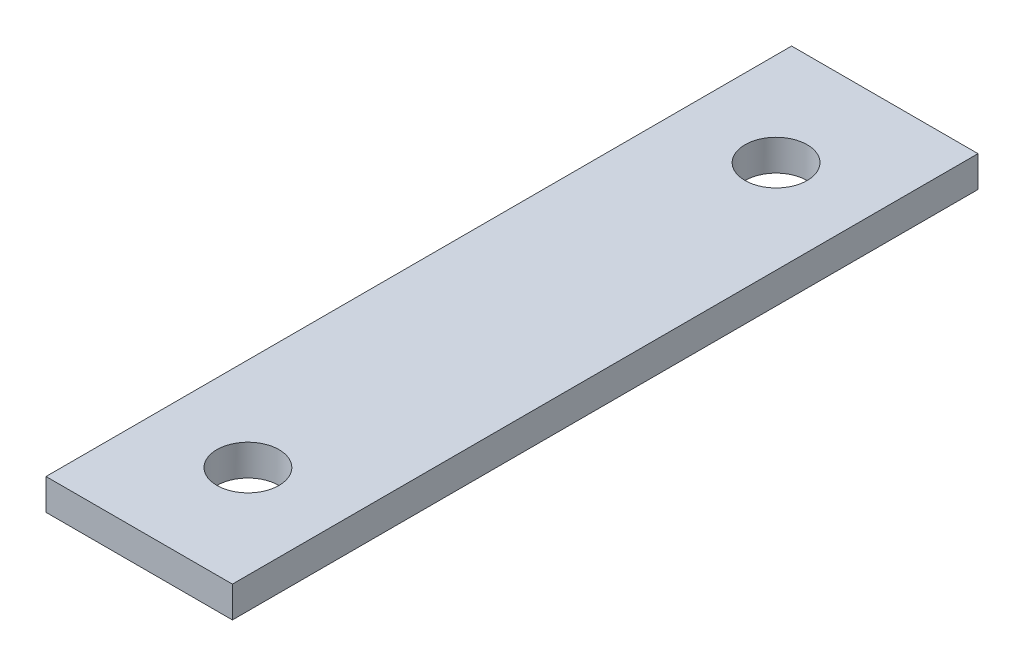
ISO-10303-21;
HEADER;
FILE_DESCRIPTION(('STEP AP214'),'2;1');
FILE_NAME('part.step','',(''),(''),'','','');
FILE_SCHEMA(('AUTOMOTIVE_DESIGN { 1 0 10303 214 1 1 1 1 }'));
ENDSEC;
DATA;
#1=APPLICATION_CONTEXT('core data for automotive mechanical design processes');
#2=APPLICATION_PROTOCOL_DEFINITION('international standard','automotive_design',2000,#1);
#3=PRODUCT_CONTEXT('',#1,'mechanical');
#4=PRODUCT('Part','Part','',(#3));
#5=PRODUCT_RELATED_PRODUCT_CATEGORY('part','',(#4));
#6=PRODUCT_DEFINITION_FORMATION('','',#4);
#7=PRODUCT_DEFINITION_CONTEXT('part definition',#1,'design');
#8=PRODUCT_DEFINITION('design','',#6,#7);
#9=PRODUCT_DEFINITION_SHAPE('','',#8);
#10=(LENGTH_UNIT() NAMED_UNIT(*) SI_UNIT(.MILLI.,.METRE.));
#11=(NAMED_UNIT(*) PLANE_ANGLE_UNIT() SI_UNIT($,.RADIAN.));
#12=(NAMED_UNIT(*) SI_UNIT($,.STERADIAN.) SOLID_ANGLE_UNIT());
#13=UNCERTAINTY_MEASURE_WITH_UNIT(LENGTH_MEASURE(1.E-05),#10,'distance_accuracy_value','');
#14=(GEOMETRIC_REPRESENTATION_CONTEXT(3) GLOBAL_UNCERTAINTY_ASSIGNED_CONTEXT((#13)) GLOBAL_UNIT_ASSIGNED_CONTEXT((#10,
#11,#12)) REPRESENTATION_CONTEXT('',''));
#15=CARTESIAN_POINT('',(0.,0.,0.));
#16=DIRECTION('',(0.,0.,1.));
#17=DIRECTION('',(1.,0.,0.));
#18=AXIS2_PLACEMENT_3D('',#15,#16,#17);
#19=CARTESIAN_POINT('',(1.5,0.5,3.23181818181818));
#20=DIRECTION('',(-1.,0.,0.));
#21=DIRECTION('',(0.,0.,1.));
#22=AXIS2_PLACEMENT_3D('',#19,#20,#21);
#23=PLANE('',#22);
#24=DIRECTION('',(0.,0.,-1.));
#25=VECTOR('',#24,1.);
#26=CARTESIAN_POINT('',(1.5,0.,3.23181818181818));
#27=LINE('',#26,#25);
#28=CARTESIAN_POINT('',(1.5,0.,3.23181818181818));
#29=VERTEX_POINT('',#28);
#30=CARTESIAN_POINT('',(1.5,0.,-8.76818181818182));
#31=VERTEX_POINT('',#30);
#32=EDGE_CURVE('E107',#29,#31,#27,.T.);
#33=ORIENTED_EDGE('',*,*,#32,.T.);
#34=DIRECTION('',(0.,-1.,0.));
#35=VECTOR('',#34,1.);
#36=CARTESIAN_POINT('',(1.5,0.5,-8.76818181818182));
#37=LINE('',#36,#35);
#38=CARTESIAN_POINT('',(1.5,0.5,-8.76818181818182));
#39=VERTEX_POINT('',#38);
#40=EDGE_CURVE('E11',#39,#31,#37,.T.);
#41=ORIENTED_EDGE('',*,*,#40,.F.);
#42=DIRECTION('',(0.,0.,-1.));
#43=VECTOR('',#42,1.);
#44=CARTESIAN_POINT('',(1.5,0.5,3.23181818181818));
#45=LINE('',#44,#43);
#46=CARTESIAN_POINT('',(1.5,0.5,3.23181818181818));
#47=VERTEX_POINT('',#46);
#48=EDGE_CURVE('E94',#47,#39,#45,.T.);
#49=ORIENTED_EDGE('',*,*,#48,.F.);
#50=DIRECTION('',(0.,-1.,0.));
#51=VECTOR('',#50,1.);
#52=CARTESIAN_POINT('',(1.5,0.5,3.23181818181818));
#53=LINE('',#52,#51);
#54=EDGE_CURVE('E103',#47,#29,#53,.T.);
#55=ORIENTED_EDGE('',*,*,#54,.T.);
#56=EDGE_LOOP('',(#33,#41,#49,#55));
#57=FACE_BOUND('',#56,.T.);
#58=ADVANCED_FACE('F41',(#57),#23,.F.);
#59=CARTESIAN_POINT('',(-1.5,0.5,-8.76818181818182));
#60=DIRECTION('',(0.,0.,1.));
#61=DIRECTION('',(1.,0.,0.));
#62=AXIS2_PLACEMENT_3D('',#59,#60,#61);
#63=PLANE('',#62);
#64=DIRECTION('',(-1.,0.,0.));
#65=VECTOR('',#64,1.);
#66=CARTESIAN_POINT('',(-1.5,0.,-8.76818181818182));
#67=LINE('',#66,#65);
#68=CARTESIAN_POINT('',(-1.5,0.,-8.76818181818182));
#69=VERTEX_POINT('',#68);
#70=EDGE_CURVE('E98',#31,#69,#67,.T.);
#71=ORIENTED_EDGE('',*,*,#70,.T.);
#72=DIRECTION('',(0.,-1.,0.));
#73=VECTOR('',#72,1.);
#74=CARTESIAN_POINT('',(-1.5,0.5,-8.76818181818182));
#75=LINE('',#74,#73);
#76=CARTESIAN_POINT('',(-1.5,0.5,-8.76818181818182));
#77=VERTEX_POINT('',#76);
#78=EDGE_CURVE('E50',#77,#69,#75,.T.);
#79=ORIENTED_EDGE('',*,*,#78,.F.);
#80=DIRECTION('',(-1.,0.,0.));
#81=VECTOR('',#80,1.);
#82=CARTESIAN_POINT('',(-1.5,0.5,-8.76818181818182));
#83=LINE('',#82,#81);
#84=EDGE_CURVE('E89',#39,#77,#83,.T.);
#85=ORIENTED_EDGE('',*,*,#84,.F.);
#86=ORIENTED_EDGE('',*,*,#40,.T.);
#87=EDGE_LOOP('',(#71,#79,#85,#86));
#88=FACE_BOUND('',#87,.T.);
#89=ADVANCED_FACE('F97',(#88),#63,.F.);
#90=CARTESIAN_POINT('',(-1.5,0.5,3.23181818181818));
#91=DIRECTION('',(1.,0.,0.));
#92=DIRECTION('',(0.,0.,-1.));
#93=AXIS2_PLACEMENT_3D('',#90,#91,#92);
#94=PLANE('',#93);
#95=DIRECTION('',(0.,0.,1.));
#96=VECTOR('',#95,1.);
#97=CARTESIAN_POINT('',(-1.5,0.,3.23181818181818));
#98=LINE('',#97,#96);
#99=CARTESIAN_POINT('',(-1.5,0.,3.23181818181818));
#100=VERTEX_POINT('',#99);
#101=EDGE_CURVE('E76',#69,#100,#98,.T.);
#102=ORIENTED_EDGE('',*,*,#101,.T.);
#103=DIRECTION('',(0.,-1.,0.));
#104=VECTOR('',#103,1.);
#105=CARTESIAN_POINT('',(-1.5,0.5,3.23181818181818));
#106=LINE('',#105,#104);
#107=CARTESIAN_POINT('',(-1.5,0.5,3.23181818181818));
#108=VERTEX_POINT('',#107);
#109=EDGE_CURVE('E99',#108,#100,#106,.T.);
#110=ORIENTED_EDGE('',*,*,#109,.F.);
#111=DIRECTION('',(0.,0.,1.));
#112=VECTOR('',#111,1.);
#113=CARTESIAN_POINT('',(-1.5,0.5,3.23181818181818));
#114=LINE('',#113,#112);
#115=EDGE_CURVE('E92',#77,#108,#114,.T.);
#116=ORIENTED_EDGE('',*,*,#115,.F.);
#117=ORIENTED_EDGE('',*,*,#78,.T.);
#118=EDGE_LOOP('',(#102,#110,#116,#117));
#119=FACE_BOUND('',#118,.T.);
#120=ADVANCED_FACE('F101',(#119),#94,.F.);
#121=CARTESIAN_POINT('',(-1.5,0.5,3.23181818181818));
#122=DIRECTION('',(0.,0.,-1.));
#123=DIRECTION('',(-1.,0.,0.));
#124=AXIS2_PLACEMENT_3D('',#121,#122,#123);
#125=PLANE('',#124);
#126=DIRECTION('',(1.,0.,0.));
#127=VECTOR('',#126,1.);
#128=CARTESIAN_POINT('',(-1.5,0.,3.23181818181818));
#129=LINE('',#128,#127);
#130=EDGE_CURVE('E82',#100,#29,#129,.T.);
#131=ORIENTED_EDGE('',*,*,#130,.T.);
#132=ORIENTED_EDGE('',*,*,#54,.F.);
#133=DIRECTION('',(1.,0.,0.));
#134=VECTOR('',#133,1.);
#135=CARTESIAN_POINT('',(-1.5,0.5,3.23181818181818));
#136=LINE('',#135,#134);
#137=EDGE_CURVE('E59',#108,#47,#136,.T.);
#138=ORIENTED_EDGE('',*,*,#137,.F.);
#139=ORIENTED_EDGE('',*,*,#109,.T.);
#140=EDGE_LOOP('',(#131,#132,#138,#139));
#141=FACE_BOUND('',#140,.T.);
#142=ADVANCED_FACE('F133',(#141),#125,.F.);
#143=CARTESIAN_POINT('',(0.,0.5,0.));
#144=DIRECTION('',(0.,-1.,0.));
#145=DIRECTION('',(0.,0.,-1.));
#146=AXIS2_PLACEMENT_3D('',#143,#144,#145);
#147=PLANE('',#146);
#148=CARTESIAN_POINT('',(0.,0.5,-7.01818181818182));
#149=DIRECTION('',(0.,1.,0.));
#150=DIRECTION('',(0.,0.,1.));
#151=AXIS2_PLACEMENT_3D('',#148,#149,#150);
#152=CIRCLE('',#151,0.5);
#153=CARTESIAN_POINT('',(0.,0.5,-6.51818181818182));
#154=VERTEX_POINT('',#153);
#155=EDGE_CURVE('E116',#154,#154,#152,.T.);
#156=ORIENTED_EDGE('',*,*,#155,.F.);
#157=EDGE_LOOP('',(#156));
#158=FACE_BOUND('',#157,.T.);
#159=CARTESIAN_POINT('',(0.,0.5,1.48181818181818));
#160=DIRECTION('',(0.,1.,0.));
#161=DIRECTION('',(0.,0.,1.));
#162=AXIS2_PLACEMENT_3D('',#159,#160,#161);
#163=CIRCLE('',#162,0.5);
#164=CARTESIAN_POINT('',(0.,0.5,1.98181818181818));
#165=VERTEX_POINT('',#164);
#166=EDGE_CURVE('E121',#165,#165,#163,.T.);
#167=ORIENTED_EDGE('',*,*,#166,.F.);
#168=EDGE_LOOP('',(#167));
#169=FACE_BOUND('',#168,.T.);
#170=ORIENTED_EDGE('',*,*,#48,.T.);
#171=ORIENTED_EDGE('',*,*,#84,.T.);
#172=ORIENTED_EDGE('',*,*,#115,.T.);
#173=ORIENTED_EDGE('',*,*,#137,.T.);
#174=EDGE_LOOP('',(#170,#171,#172,#173));
#175=FACE_BOUND('',#174,.T.);
#176=ADVANCED_FACE('F90',(#158,#169,#175),#147,.F.);
#177=CARTESIAN_POINT('',(0.,0.,0.));
#178=DIRECTION('',(0.,-1.,0.));
#179=DIRECTION('',(0.,0.,-1.));
#180=AXIS2_PLACEMENT_3D('',#177,#178,#179);
#181=PLANE('',#180);
#182=CARTESIAN_POINT('',(0.,0.,-7.01818181818182));
#183=DIRECTION('',(0.,-1.,0.));
#184=DIRECTION('',(0.,0.,-1.));
#185=AXIS2_PLACEMENT_3D('',#182,#183,#184);
#186=CIRCLE('',#185,0.5);
#187=CARTESIAN_POINT('',(0.,0.,-7.51818181818182));
#188=VERTEX_POINT('',#187);
#189=EDGE_CURVE('E44',#188,#188,#186,.T.);
#190=ORIENTED_EDGE('',*,*,#189,.F.);
#191=EDGE_LOOP('',(#190));
#192=FACE_BOUND('',#191,.T.);
#193=CARTESIAN_POINT('',(0.,0.,1.48181818181818));
#194=DIRECTION('',(0.,-1.,0.));
#195=DIRECTION('',(0.,0.,-1.));
#196=AXIS2_PLACEMENT_3D('',#193,#194,#195);
#197=CIRCLE('',#196,0.5);
#198=CARTESIAN_POINT('',(0.,0.,0.981818181818179));
#199=VERTEX_POINT('',#198);
#200=EDGE_CURVE('E114',#199,#199,#197,.T.);
#201=ORIENTED_EDGE('',*,*,#200,.F.);
#202=EDGE_LOOP('',(#201));
#203=FACE_BOUND('',#202,.T.);
#204=ORIENTED_EDGE('',*,*,#32,.F.);
#205=ORIENTED_EDGE('',*,*,#130,.F.);
#206=ORIENTED_EDGE('',*,*,#101,.F.);
#207=ORIENTED_EDGE('',*,*,#70,.F.);
#208=EDGE_LOOP('',(#204,#205,#206,#207));
#209=FACE_BOUND('',#208,.T.);
#210=ADVANCED_FACE('F132',(#192,#203,#209),#181,.T.);
#211=CARTESIAN_POINT('',(0.,-0.5,1.48181818181818));
#212=DIRECTION('',(0.,1.,0.));
#213=DIRECTION('',(0.,0.,1.));
#214=AXIS2_PLACEMENT_3D('',#211,#212,#213);
#215=CYLINDRICAL_SURFACE('',#214,0.5);
#216=ORIENTED_EDGE('',*,*,#200,.T.);
#217=EDGE_LOOP('',(#216));
#218=FACE_BOUND('',#217,.T.);
#219=ORIENTED_EDGE('',*,*,#166,.T.);
#220=EDGE_LOOP('',(#219));
#221=FACE_BOUND('',#220,.T.);
#222=ADVANCED_FACE('F129',(#218,#221),#215,.F.);
#223=CARTESIAN_POINT('',(0.,-0.5,-7.01818181818182));
#224=DIRECTION('',(0.,1.,0.));
#225=DIRECTION('',(0.,0.,1.));
#226=AXIS2_PLACEMENT_3D('',#223,#224,#225);
#227=CYLINDRICAL_SURFACE('',#226,0.5);
#228=ORIENTED_EDGE('',*,*,#189,.T.);
#229=EDGE_LOOP('',(#228));
#230=FACE_BOUND('',#229,.T.);
#231=ORIENTED_EDGE('',*,*,#155,.T.);
#232=EDGE_LOOP('',(#231));
#233=FACE_BOUND('',#232,.T.);
#234=ADVANCED_FACE('F183',(#230,#233),#227,.F.);
#235=CLOSED_SHELL('',(#58,#89,#120,#142,#176,#210,#222,#234));
#236=MANIFOLD_SOLID_BREP('B2',#235);
#237=ADVANCED_BREP_SHAPE_REPRESENTATION('',(#18,#236),#14);
#238=SHAPE_DEFINITION_REPRESENTATION(#9,#237);
ENDSEC;
END-ISO-10303-21;
